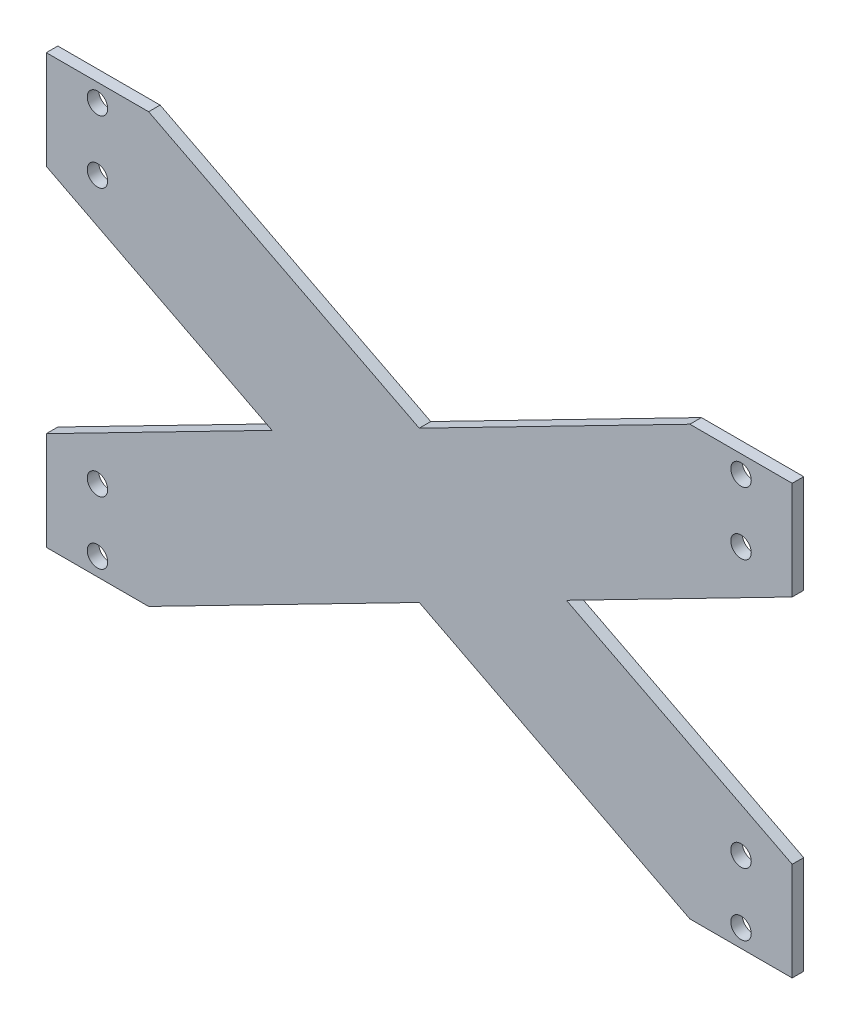
ISO-10303-21;
HEADER;
FILE_DESCRIPTION(('STEP AP214'),'2;1');
FILE_NAME('part.step','',(''),(''),'','','');
FILE_SCHEMA(('AUTOMOTIVE_DESIGN { 1 0 10303 214 1 1 1 1 }'));
ENDSEC;
DATA;
#1=APPLICATION_CONTEXT('core data for automotive mechanical design processes');
#2=APPLICATION_PROTOCOL_DEFINITION('international standard','automotive_design',2000,#1);
#3=PRODUCT_CONTEXT('',#1,'mechanical');
#4=PRODUCT('Part','Part','',(#3));
#5=PRODUCT_RELATED_PRODUCT_CATEGORY('part','',(#4));
#6=PRODUCT_DEFINITION_FORMATION('','',#4);
#7=PRODUCT_DEFINITION_CONTEXT('part definition',#1,'design');
#8=PRODUCT_DEFINITION('design','',#6,#7);
#9=PRODUCT_DEFINITION_SHAPE('','',#8);
#10=(LENGTH_UNIT() NAMED_UNIT(*) SI_UNIT(.MILLI.,.METRE.));
#11=(NAMED_UNIT(*) PLANE_ANGLE_UNIT() SI_UNIT($,.RADIAN.));
#12=(NAMED_UNIT(*) SI_UNIT($,.STERADIAN.) SOLID_ANGLE_UNIT());
#13=UNCERTAINTY_MEASURE_WITH_UNIT(LENGTH_MEASURE(1.E-05),#10,'distance_accuracy_value','');
#14=(GEOMETRIC_REPRESENTATION_CONTEXT(3) GLOBAL_UNCERTAINTY_ASSIGNED_CONTEXT((#13)) GLOBAL_UNIT_ASSIGNED_CONTEXT((#10,
#11,#12)) REPRESENTATION_CONTEXT('',''));
#15=CARTESIAN_POINT('',(0.,0.,0.));
#16=DIRECTION('',(0.,0.,1.));
#17=DIRECTION('',(1.,0.,0.));
#18=AXIS2_PLACEMENT_3D('',#15,#16,#17);
#19=CARTESIAN_POINT('',(69.3272628310759,-135.215033552703,4.5));
#20=DIRECTION('',(0.456244842629436,-0.88985428221369,0.));
#21=DIRECTION('',(0.88985428221369,0.456244842629436,0.));
#22=AXIS2_PLACEMENT_3D('',#19,#20,#21);
#23=PLANE('',#22);
#24=DIRECTION('',(-0.88985428221369,-0.456244842629436,0.));
#25=VECTOR('',#24,1.);
#26=CARTESIAN_POINT('',(69.3272628310759,-135.215033552703,0.));
#27=LINE('',#26,#25);
#28=CARTESIAN_POINT('',(152.142010442395,-92.7543720190779,0.));
#29=VERTEX_POINT('',#28);
#30=CARTESIAN_POINT('',(46.3420104423945,-147.,0.));
#31=VERTEX_POINT('',#30);
#32=EDGE_CURVE('E217',#29,#31,#27,.T.);
#33=ORIENTED_EDGE('',*,*,#32,.F.);
#34=DIRECTION('',(0.,0.,-1.));
#35=VECTOR('',#34,1.);
#36=CARTESIAN_POINT('',(152.142010442395,-92.7543720190779,4.5));
#37=LINE('',#36,#35);
#38=CARTESIAN_POINT('',(152.142010442395,-92.7543720190779,4.5));
#39=VERTEX_POINT('',#38);
#40=EDGE_CURVE('E11',#39,#29,#37,.T.);
#41=ORIENTED_EDGE('',*,*,#40,.F.);
#42=DIRECTION('',(-0.88985428221369,-0.456244842629436,0.));
#43=VECTOR('',#42,1.);
#44=CARTESIAN_POINT('',(69.3272628310759,-135.215033552703,4.5));
#45=LINE('',#44,#43);
#46=CARTESIAN_POINT('',(46.3420104423945,-147.,4.5));
#47=VERTEX_POINT('',#46);
#48=EDGE_CURVE('E393',#39,#47,#45,.T.);
#49=ORIENTED_EDGE('',*,*,#48,.T.);
#50=DIRECTION('',(0.,0.,-1.));
#51=VECTOR('',#50,1.);
#52=CARTESIAN_POINT('',(46.3420104423945,-147.,4.5));
#53=LINE('',#52,#51);
#54=EDGE_CURVE('E110',#47,#31,#53,.T.);
#55=ORIENTED_EDGE('',*,*,#54,.T.);
#56=EDGE_LOOP('',(#33,#41,#49,#55));
#57=FACE_BOUND('',#56,.T.);
#58=ADVANCED_FACE('F35',(#57),#23,.T.);
#59=CARTESIAN_POINT('',(-5.98769687299524,-11.6783297150822,4.5));
#60=DIRECTION('',(0.456244842629436,0.88985428221369,0.));
#61=DIRECTION('',(-0.88985428221369,0.456244842629436,0.));
#62=AXIS2_PLACEMENT_3D('',#59,#60,#61);
#63=PLANE('',#62);
#64=DIRECTION('',(0.88985428221369,-0.456244842629436,0.));
#65=VECTOR('',#64,1.);
#66=CARTESIAN_POINT('',(-5.98769687299524,-11.6783297150822,0.));
#67=LINE('',#66,#65);
#68=CARTESIAN_POINT('',(257.942010442395,-147.,0.));
#69=VERTEX_POINT('',#68);
#70=EDGE_CURVE('E215',#29,#69,#67,.T.);
#71=ORIENTED_EDGE('',*,*,#70,.T.);
#72=DIRECTION('',(0.,0.,-1.));
#73=VECTOR('',#72,1.);
#74=CARTESIAN_POINT('',(257.942010442395,-147.,4.5));
#75=LINE('',#74,#73);
#76=CARTESIAN_POINT('',(257.942010442395,-147.,4.5));
#77=VERTEX_POINT('',#76);
#78=EDGE_CURVE('E44',#77,#69,#75,.T.);
#79=ORIENTED_EDGE('',*,*,#78,.F.);
#80=DIRECTION('',(0.88985428221369,-0.456244842629436,0.));
#81=VECTOR('',#80,1.);
#82=CARTESIAN_POINT('',(-5.98769687299524,-11.6783297150822,4.5));
#83=LINE('',#82,#81);
#84=EDGE_CURVE('E395',#39,#77,#83,.T.);
#85=ORIENTED_EDGE('',*,*,#84,.F.);
#86=ORIENTED_EDGE('',*,*,#40,.T.);
#87=EDGE_LOOP('',(#71,#79,#85,#86));
#88=FACE_BOUND('',#87,.T.);
#89=ADVANCED_FACE('F216',(#88),#63,.F.);
#90=CARTESIAN_POINT('',(0.,-147.,4.5));
#91=DIRECTION('',(0.,1.,0.));
#92=DIRECTION('',(0.,0.,1.));
#93=AXIS2_PLACEMENT_3D('',#90,#91,#92);
#94=PLANE('',#93);
#95=DIRECTION('',(1.,0.,0.));
#96=VECTOR('',#95,1.);
#97=CARTESIAN_POINT('',(0.,-147.,0.));
#98=LINE('',#97,#96);
#99=CARTESIAN_POINT('',(297.942010442395,-147.,0.));
#100=VERTEX_POINT('',#99);
#101=EDGE_CURVE('E209',#69,#100,#98,.T.);
#102=ORIENTED_EDGE('',*,*,#101,.T.);
#103=DIRECTION('',(0.,0.,-1.));
#104=VECTOR('',#103,1.);
#105=CARTESIAN_POINT('',(297.942010442395,-147.,4.5));
#106=LINE('',#105,#104);
#107=CARTESIAN_POINT('',(297.942010442395,-147.,4.5));
#108=VERTEX_POINT('',#107);
#109=EDGE_CURVE('E201',#108,#100,#106,.T.);
#110=ORIENTED_EDGE('',*,*,#109,.F.);
#111=DIRECTION('',(1.,0.,0.));
#112=VECTOR('',#111,1.);
#113=CARTESIAN_POINT('',(0.,-147.,4.5));
#114=LINE('',#113,#112);
#115=EDGE_CURVE('E211',#77,#108,#114,.T.);
#116=ORIENTED_EDGE('',*,*,#115,.F.);
#117=ORIENTED_EDGE('',*,*,#78,.T.);
#118=EDGE_LOOP('',(#102,#110,#116,#117));
#119=FACE_BOUND('',#118,.T.);
#120=ADVANCED_FACE('F207',(#119),#94,.F.);
#121=CARTESIAN_POINT('',(297.942010442395,0.,4.5));
#122=DIRECTION('',(1.,0.,0.));
#123=DIRECTION('',(0.,0.,-1.));
#124=AXIS2_PLACEMENT_3D('',#121,#122,#123);
#125=PLANE('',#124);
#126=DIRECTION('',(0.,-1.,0.));
#127=VECTOR('',#126,1.);
#128=CARTESIAN_POINT('',(297.942010442395,0.,0.));
#129=LINE('',#128,#127);
#130=CARTESIAN_POINT('',(297.942010442395,-108.5,0.));
#131=VERTEX_POINT('',#130);
#132=EDGE_CURVE('E219',#131,#100,#129,.T.);
#133=ORIENTED_EDGE('',*,*,#132,.F.);
#134=DIRECTION('',(0.,0.,-1.));
#135=VECTOR('',#134,1.);
#136=CARTESIAN_POINT('',(297.942010442395,-108.5,4.5));
#137=LINE('',#136,#135);
#138=CARTESIAN_POINT('',(297.942010442395,-108.5,4.5));
#139=VERTEX_POINT('',#138);
#140=EDGE_CURVE('E199',#139,#131,#137,.T.);
#141=ORIENTED_EDGE('',*,*,#140,.F.);
#142=DIRECTION('',(0.,-1.,0.));
#143=VECTOR('',#142,1.);
#144=CARTESIAN_POINT('',(297.942010442395,0.,4.5));
#145=LINE('',#144,#143);
#146=EDGE_CURVE('E401',#139,#108,#145,.T.);
#147=ORIENTED_EDGE('',*,*,#146,.T.);
#148=ORIENTED_EDGE('',*,*,#109,.T.);
#149=EDGE_LOOP('',(#133,#141,#147,#148));
#150=FACE_BOUND('',#149,.T.);
#151=ADVANCED_FACE('F316',(#150),#125,.T.);
#152=CARTESIAN_POINT('',(17.9693473216841,35.047192140587,4.5));
#153=DIRECTION('',(-0.456244842629436,-0.88985428221369,0.));
#154=DIRECTION('',(0.88985428221369,-0.456244842629436,0.));
#155=AXIS2_PLACEMENT_3D('',#152,#153,#154);
#156=PLANE('',#155);
#157=DIRECTION('',(-0.88985428221369,0.456244842629436,0.));
#158=VECTOR('',#157,1.);
#159=CARTESIAN_POINT('',(17.9693473216841,35.047192140587,0.));
#160=LINE('',#159,#158);
#161=CARTESIAN_POINT('',(209.686971682705,-63.2499999999999,0.));
#162=VERTEX_POINT('',#161);
#163=EDGE_CURVE('E226',#131,#162,#160,.T.);
#164=ORIENTED_EDGE('',*,*,#163,.T.);
#165=DIRECTION('',(0.,0.,-1.));
#166=VECTOR('',#165,1.);
#167=CARTESIAN_POINT('',(209.686971682705,-63.2499999999999,4.5));
#168=LINE('',#167,#166);
#169=CARTESIAN_POINT('',(209.686971682705,-63.2499999999999,4.5));
#170=VERTEX_POINT('',#169);
#171=EDGE_CURVE('E197',#170,#162,#168,.T.);
#172=ORIENTED_EDGE('',*,*,#171,.F.);
#173=DIRECTION('',(-0.88985428221369,0.456244842629436,0.));
#174=VECTOR('',#173,1.);
#175=CARTESIAN_POINT('',(17.9693473216841,35.047192140587,4.5));
#176=LINE('',#175,#174);
#177=EDGE_CURVE('E404',#139,#170,#176,.T.);
#178=ORIENTED_EDGE('',*,*,#177,.F.);
#179=ORIENTED_EDGE('',*,*,#140,.T.);
#180=EDGE_LOOP('',(#164,#172,#178,#179));
#181=FACE_BOUND('',#180,.T.);
#182=ADVANCED_FACE('F319',(#181),#156,.F.);
#183=CARTESIAN_POINT('',(69.3272628310759,-135.215033552703,4.5));
#184=DIRECTION('',(0.456244842629436,-0.88985428221369,0.));
#185=DIRECTION('',(0.88985428221369,0.456244842629436,0.));
#186=AXIS2_PLACEMENT_3D('',#183,#184,#185);
#187=PLANE('',#186);
#188=DIRECTION('',(-0.88985428221369,-0.456244842629436,0.));
#189=VECTOR('',#188,1.);
#190=CARTESIAN_POINT('',(69.3272628310759,-135.215033552703,0.));
#191=LINE('',#190,#189);
#192=CARTESIAN_POINT('',(297.942010442395,-17.9999999999999,0.));
#193=VERTEX_POINT('',#192);
#194=EDGE_CURVE('E229',#193,#162,#191,.T.);
#195=ORIENTED_EDGE('',*,*,#194,.F.);
#196=DIRECTION('',(0.,0.,-1.));
#197=VECTOR('',#196,1.);
#198=CARTESIAN_POINT('',(297.942010442395,-17.9999999999999,4.5));
#199=LINE('',#198,#197);
#200=CARTESIAN_POINT('',(297.942010442395,-17.9999999999999,4.5));
#201=VERTEX_POINT('',#200);
#202=EDGE_CURVE('E195',#201,#193,#199,.T.);
#203=ORIENTED_EDGE('',*,*,#202,.F.);
#204=DIRECTION('',(-0.88985428221369,-0.456244842629436,0.));
#205=VECTOR('',#204,1.);
#206=CARTESIAN_POINT('',(69.3272628310759,-135.215033552703,4.5));
#207=LINE('',#206,#205);
#208=EDGE_CURVE('E406',#201,#170,#207,.T.);
#209=ORIENTED_EDGE('',*,*,#208,.T.);
#210=ORIENTED_EDGE('',*,*,#171,.T.);
#211=EDGE_LOOP('',(#195,#203,#209,#210));
#212=FACE_BOUND('',#211,.T.);
#213=ADVANCED_FACE('F323',(#212),#187,.T.);
#214=CARTESIAN_POINT('',(297.942010442395,0.,4.5));
#215=DIRECTION('',(1.,0.,0.));
#216=DIRECTION('',(0.,0.,-1.));
#217=AXIS2_PLACEMENT_3D('',#214,#215,#216);
#218=PLANE('',#217);
#219=DIRECTION('',(0.,-1.,0.));
#220=VECTOR('',#219,1.);
#221=CARTESIAN_POINT('',(297.942010442395,0.,0.));
#222=LINE('',#221,#220);
#223=CARTESIAN_POINT('',(297.942010442395,20.5000000000001,0.));
#224=VERTEX_POINT('',#223);
#225=EDGE_CURVE('E232',#224,#193,#222,.T.);
#226=ORIENTED_EDGE('',*,*,#225,.F.);
#227=DIRECTION('',(0.,0.,-1.));
#228=VECTOR('',#227,1.);
#229=CARTESIAN_POINT('',(297.942010442395,20.5000000000001,4.5));
#230=LINE('',#229,#228);
#231=CARTESIAN_POINT('',(297.942010442395,20.5000000000001,4.5));
#232=VERTEX_POINT('',#231);
#233=EDGE_CURVE('E193',#232,#224,#230,.T.);
#234=ORIENTED_EDGE('',*,*,#233,.F.);
#235=DIRECTION('',(0.,-1.,0.));
#236=VECTOR('',#235,1.);
#237=CARTESIAN_POINT('',(297.942010442395,0.,4.5));
#238=LINE('',#237,#236);
#239=EDGE_CURVE('E409',#232,#201,#238,.T.);
#240=ORIENTED_EDGE('',*,*,#239,.T.);
#241=ORIENTED_EDGE('',*,*,#202,.T.);
#242=EDGE_LOOP('',(#226,#234,#240,#241));
#243=FACE_BOUND('',#242,.T.);
#244=ADVANCED_FACE('F327',(#243),#218,.T.);
#245=CARTESIAN_POINT('',(0.,20.5000000000001,4.5));
#246=DIRECTION('',(0.,1.,0.));
#247=DIRECTION('',(-1.,0.,0.));
#248=AXIS2_PLACEMENT_3D('',#245,#246,#247);
#249=PLANE('',#248);
#250=DIRECTION('',(1.,0.,0.));
#251=VECTOR('',#250,1.);
#252=CARTESIAN_POINT('',(0.,20.5000000000001,0.));
#253=LINE('',#252,#251);
#254=CARTESIAN_POINT('',(257.942010442395,20.5000000000001,0.));
#255=VERTEX_POINT('',#254);
#256=EDGE_CURVE('E235',#255,#224,#253,.T.);
#257=ORIENTED_EDGE('',*,*,#256,.F.);
#258=DIRECTION('',(0.,0.,-1.));
#259=VECTOR('',#258,1.);
#260=CARTESIAN_POINT('',(257.942010442395,20.5000000000001,4.5));
#261=LINE('',#260,#259);
#262=CARTESIAN_POINT('',(257.942010442395,20.5000000000001,4.5));
#263=VERTEX_POINT('',#262);
#264=EDGE_CURVE('E191',#263,#255,#261,.T.);
#265=ORIENTED_EDGE('',*,*,#264,.F.);
#266=DIRECTION('',(1.,0.,0.));
#267=VECTOR('',#266,1.);
#268=CARTESIAN_POINT('',(0.,20.5000000000001,4.5));
#269=LINE('',#268,#267);
#270=EDGE_CURVE('E412',#263,#232,#269,.T.);
#271=ORIENTED_EDGE('',*,*,#270,.T.);
#272=ORIENTED_EDGE('',*,*,#233,.T.);
#273=EDGE_LOOP('',(#257,#265,#271,#272));
#274=FACE_BOUND('',#273,.T.);
#275=ADVANCED_FACE('F331',(#274),#249,.T.);
#276=CARTESIAN_POINT('',(45.3702186363966,-88.4895116970339,4.5));
#277=DIRECTION('',(0.456244842629436,-0.88985428221369,0.));
#278=DIRECTION('',(0.88985428221369,0.456244842629436,0.));
#279=AXIS2_PLACEMENT_3D('',#276,#277,#278);
#280=PLANE('',#279);
#281=DIRECTION('',(-0.88985428221369,-0.456244842629436,0.));
#282=VECTOR('',#281,1.);
#283=CARTESIAN_POINT('',(45.3702186363966,-88.4895116970339,0.));
#284=LINE('',#283,#282);
#285=CARTESIAN_POINT('',(152.142010442395,-33.745627980922,0.));
#286=VERTEX_POINT('',#285);
#287=EDGE_CURVE('E238',#255,#286,#284,.T.);
#288=ORIENTED_EDGE('',*,*,#287,.T.);
#289=DIRECTION('',(0.,0.,-1.));
#290=VECTOR('',#289,1.);
#291=CARTESIAN_POINT('',(152.142010442395,-33.745627980922,4.5));
#292=LINE('',#291,#290);
#293=CARTESIAN_POINT('',(152.142010442395,-33.745627980922,4.5));
#294=VERTEX_POINT('',#293);
#295=EDGE_CURVE('E188',#294,#286,#292,.T.);
#296=ORIENTED_EDGE('',*,*,#295,.F.);
#297=DIRECTION('',(-0.88985428221369,-0.456244842629436,0.));
#298=VECTOR('',#297,1.);
#299=CARTESIAN_POINT('',(45.3702186363966,-88.4895116970339,4.5));
#300=LINE('',#299,#298);
#301=EDGE_CURVE('E415',#263,#294,#300,.T.);
#302=ORIENTED_EDGE('',*,*,#301,.F.);
#303=ORIENTED_EDGE('',*,*,#264,.T.);
#304=EDGE_LOOP('',(#288,#296,#302,#303));
#305=FACE_BOUND('',#304,.T.);
#306=ADVANCED_FACE('F335',(#305),#280,.F.);
#307=CARTESIAN_POINT('',(17.9693473216841,35.047192140587,4.5));
#308=DIRECTION('',(-0.456244842629436,-0.88985428221369,0.));
#309=DIRECTION('',(0.88985428221369,-0.456244842629436,0.));
#310=AXIS2_PLACEMENT_3D('',#307,#308,#309);
#311=PLANE('',#310);
#312=DIRECTION('',(-0.88985428221369,0.456244842629436,0.));
#313=VECTOR('',#312,1.);
#314=CARTESIAN_POINT('',(17.9693473216841,35.047192140587,0.));
#315=LINE('',#314,#313);
#316=CARTESIAN_POINT('',(46.3420104423947,20.5000000000001,0.));
#317=VERTEX_POINT('',#316);
#318=EDGE_CURVE('E241',#286,#317,#315,.T.);
#319=ORIENTED_EDGE('',*,*,#318,.T.);
#320=DIRECTION('',(0.,0.,-1.));
#321=VECTOR('',#320,1.);
#322=CARTESIAN_POINT('',(46.3420104423947,20.5000000000001,4.5));
#323=LINE('',#322,#321);
#324=CARTESIAN_POINT('',(46.3420104423947,20.5000000000001,4.5));
#325=VERTEX_POINT('',#324);
#326=EDGE_CURVE('E186',#325,#317,#323,.T.);
#327=ORIENTED_EDGE('',*,*,#326,.F.);
#328=DIRECTION('',(-0.88985428221369,0.456244842629436,0.));
#329=VECTOR('',#328,1.);
#330=CARTESIAN_POINT('',(17.9693473216841,35.047192140587,4.5));
#331=LINE('',#330,#329);
#332=EDGE_CURVE('E418',#294,#325,#331,.T.);
#333=ORIENTED_EDGE('',*,*,#332,.F.);
#334=ORIENTED_EDGE('',*,*,#295,.T.);
#335=EDGE_LOOP('',(#319,#327,#333,#334));
#336=FACE_BOUND('',#335,.T.);
#337=ADVANCED_FACE('F339',(#336),#311,.F.);
#338=CARTESIAN_POINT('',(0.,20.5000000000001,4.5));
#339=DIRECTION('',(0.,1.,0.));
#340=DIRECTION('',(-1.,0.,0.));
#341=AXIS2_PLACEMENT_3D('',#338,#339,#340);
#342=PLANE('',#341);
#343=DIRECTION('',(1.,0.,0.));
#344=VECTOR('',#343,1.);
#345=CARTESIAN_POINT('',(0.,20.5000000000001,0.));
#346=LINE('',#345,#344);
#347=CARTESIAN_POINT('',(6.34201044239465,20.5000000000001,0.));
#348=VERTEX_POINT('',#347);
#349=EDGE_CURVE('E244',#348,#317,#346,.T.);
#350=ORIENTED_EDGE('',*,*,#349,.F.);
#351=DIRECTION('',(0.,0.,-1.));
#352=VECTOR('',#351,1.);
#353=CARTESIAN_POINT('',(6.34201044239465,20.5000000000001,4.5));
#354=LINE('',#353,#352);
#355=CARTESIAN_POINT('',(6.34201044239465,20.5000000000001,4.5));
#356=VERTEX_POINT('',#355);
#357=EDGE_CURVE('E184',#356,#348,#354,.T.);
#358=ORIENTED_EDGE('',*,*,#357,.F.);
#359=DIRECTION('',(1.,0.,0.));
#360=VECTOR('',#359,1.);
#361=CARTESIAN_POINT('',(0.,20.5000000000001,4.5));
#362=LINE('',#361,#360);
#363=EDGE_CURVE('E420',#356,#325,#362,.T.);
#364=ORIENTED_EDGE('',*,*,#363,.T.);
#365=ORIENTED_EDGE('',*,*,#326,.T.);
#366=EDGE_LOOP('',(#350,#358,#364,#365));
#367=FACE_BOUND('',#366,.T.);
#368=ADVANCED_FACE('F343',(#367),#342,.T.);
#369=CARTESIAN_POINT('',(6.34201044239465,0.,4.5));
#370=DIRECTION('',(1.,0.,0.));
#371=DIRECTION('',(0.,1.,0.));
#372=AXIS2_PLACEMENT_3D('',#369,#370,#371);
#373=PLANE('',#372);
#374=DIRECTION('',(0.,-1.,0.));
#375=VECTOR('',#374,1.);
#376=CARTESIAN_POINT('',(6.34201044239465,0.,0.));
#377=LINE('',#376,#375);
#378=CARTESIAN_POINT('',(6.34201044239465,-17.9999999999999,0.));
#379=VERTEX_POINT('',#378);
#380=EDGE_CURVE('E247',#348,#379,#377,.T.);
#381=ORIENTED_EDGE('',*,*,#380,.T.);
#382=DIRECTION('',(0.,0.,-1.));
#383=VECTOR('',#382,1.);
#384=CARTESIAN_POINT('',(6.34201044239465,-17.9999999999999,4.5));
#385=LINE('',#384,#383);
#386=CARTESIAN_POINT('',(6.34201044239465,-17.9999999999999,4.5));
#387=VERTEX_POINT('',#386);
#388=EDGE_CURVE('E177',#387,#379,#385,.T.);
#389=ORIENTED_EDGE('',*,*,#388,.F.);
#390=DIRECTION('',(0.,-1.,0.));
#391=VECTOR('',#390,1.);
#392=CARTESIAN_POINT('',(6.34201044239465,0.,4.5));
#393=LINE('',#392,#391);
#394=EDGE_CURVE('E423',#356,#387,#393,.T.);
#395=ORIENTED_EDGE('',*,*,#394,.F.);
#396=ORIENTED_EDGE('',*,*,#357,.T.);
#397=EDGE_LOOP('',(#381,#389,#395,#396));
#398=FACE_BOUND('',#397,.T.);
#399=ADVANCED_FACE('F347',(#398),#373,.F.);
#400=CARTESIAN_POINT('',(-5.98769687299524,-11.6783297150822,4.5));
#401=DIRECTION('',(0.456244842629436,0.88985428221369,0.));
#402=DIRECTION('',(-0.88985428221369,0.456244842629436,0.));
#403=AXIS2_PLACEMENT_3D('',#400,#401,#402);
#404=PLANE('',#403);
#405=DIRECTION('',(0.88985428221369,-0.456244842629436,0.));
#406=VECTOR('',#405,1.);
#407=CARTESIAN_POINT('',(-5.98769687299524,-11.6783297150822,0.));
#408=LINE('',#407,#406);
#409=CARTESIAN_POINT('',(94.5970492020846,-63.2499999999999,0.));
#410=VERTEX_POINT('',#409);
#411=EDGE_CURVE('E250',#379,#410,#408,.T.);
#412=ORIENTED_EDGE('',*,*,#411,.T.);
#413=DIRECTION('',(0.,0.,-1.));
#414=VECTOR('',#413,1.);
#415=CARTESIAN_POINT('',(94.5970492020846,-63.2499999999999,4.5));
#416=LINE('',#415,#414);
#417=CARTESIAN_POINT('',(94.5970492020846,-63.2499999999999,4.5));
#418=VERTEX_POINT('',#417);
#419=EDGE_CURVE('E175',#418,#410,#416,.T.);
#420=ORIENTED_EDGE('',*,*,#419,.F.);
#421=DIRECTION('',(0.88985428221369,-0.456244842629436,0.));
#422=VECTOR('',#421,1.);
#423=CARTESIAN_POINT('',(-5.98769687299524,-11.6783297150822,4.5));
#424=LINE('',#423,#422);
#425=EDGE_CURVE('E168',#387,#418,#424,.T.);
#426=ORIENTED_EDGE('',*,*,#425,.F.);
#427=ORIENTED_EDGE('',*,*,#388,.T.);
#428=EDGE_LOOP('',(#412,#420,#426,#427));
#429=FACE_BOUND('',#428,.T.);
#430=ADVANCED_FACE('F351',(#429),#404,.F.);
#431=CARTESIAN_POINT('',(45.3702186363966,-88.4895116970339,4.5));
#432=DIRECTION('',(0.456244842629436,-0.88985428221369,0.));
#433=DIRECTION('',(0.88985428221369,0.456244842629436,0.));
#434=AXIS2_PLACEMENT_3D('',#431,#432,#433);
#435=PLANE('',#434);
#436=DIRECTION('',(-0.88985428221369,-0.456244842629436,0.));
#437=VECTOR('',#436,1.);
#438=CARTESIAN_POINT('',(45.3702186363966,-88.4895116970339,0.));
#439=LINE('',#438,#437);
#440=CARTESIAN_POINT('',(6.34201044239466,-108.5,0.));
#441=VERTEX_POINT('',#440);
#442=EDGE_CURVE('E174',#410,#441,#439,.T.);
#443=ORIENTED_EDGE('',*,*,#442,.T.);
#444=DIRECTION('',(0.,0.,-1.));
#445=VECTOR('',#444,1.);
#446=CARTESIAN_POINT('',(6.34201044239466,-108.5,4.5));
#447=LINE('',#446,#445);
#448=CARTESIAN_POINT('',(6.34201044239466,-108.5,4.5));
#449=VERTEX_POINT('',#448);
#450=EDGE_CURVE('E159',#449,#441,#447,.T.);
#451=ORIENTED_EDGE('',*,*,#450,.F.);
#452=DIRECTION('',(-0.88985428221369,-0.456244842629436,0.));
#453=VECTOR('',#452,1.);
#454=CARTESIAN_POINT('',(45.3702186363966,-88.4895116970339,4.5));
#455=LINE('',#454,#453);
#456=EDGE_CURVE('E162',#418,#449,#455,.T.);
#457=ORIENTED_EDGE('',*,*,#456,.F.);
#458=ORIENTED_EDGE('',*,*,#419,.T.);
#459=EDGE_LOOP('',(#443,#451,#457,#458));
#460=FACE_BOUND('',#459,.T.);
#461=ADVANCED_FACE('F173',(#460),#435,.F.);
#462=CARTESIAN_POINT('',(6.34201044239465,0.,4.5));
#463=DIRECTION('',(1.,0.,0.));
#464=DIRECTION('',(0.,1.,0.));
#465=AXIS2_PLACEMENT_3D('',#462,#463,#464);
#466=PLANE('',#465);
#467=DIRECTION('',(0.,-1.,0.));
#468=VECTOR('',#467,1.);
#469=CARTESIAN_POINT('',(6.34201044239465,0.,0.));
#470=LINE('',#469,#468);
#471=CARTESIAN_POINT('',(6.34201044239466,-147.,0.));
#472=VERTEX_POINT('',#471);
#473=EDGE_CURVE('E254',#441,#472,#470,.T.);
#474=ORIENTED_EDGE('',*,*,#473,.T.);
#475=DIRECTION('',(0.,0.,-1.));
#476=VECTOR('',#475,1.);
#477=CARTESIAN_POINT('',(6.34201044239466,-147.,4.5));
#478=LINE('',#477,#476);
#479=CARTESIAN_POINT('',(6.34201044239466,-147.,4.5));
#480=VERTEX_POINT('',#479);
#481=EDGE_CURVE('E161',#480,#472,#478,.T.);
#482=ORIENTED_EDGE('',*,*,#481,.F.);
#483=DIRECTION('',(0.,-1.,0.));
#484=VECTOR('',#483,1.);
#485=CARTESIAN_POINT('',(6.34201044239465,0.,4.5));
#486=LINE('',#485,#484);
#487=EDGE_CURVE('E154',#449,#480,#486,.T.);
#488=ORIENTED_EDGE('',*,*,#487,.F.);
#489=ORIENTED_EDGE('',*,*,#450,.T.);
#490=EDGE_LOOP('',(#474,#482,#488,#489));
#491=FACE_BOUND('',#490,.T.);
#492=ADVANCED_FACE('F157',(#491),#466,.F.);
#493=CARTESIAN_POINT('',(277.942010442395,-140.,4.5));
#494=DIRECTION('',(0.,0.,-1.));
#495=DIRECTION('',(-1.,0.,0.));
#496=AXIS2_PLACEMENT_3D('',#493,#494,#495);
#497=CYLINDRICAL_SURFACE('',#496,3.99999999999999);
#498=CARTESIAN_POINT('',(277.942010442395,-140.,4.5));
#499=DIRECTION('',(0.,0.,1.));
#500=DIRECTION('',(1.,0.,0.));
#501=AXIS2_PLACEMENT_3D('',#498,#499,#500);
#502=CIRCLE('',#501,3.99999999999999);
#503=CARTESIAN_POINT('',(281.942010442395,-140.,4.5));
#504=VERTEX_POINT('',#503);
#505=EDGE_CURVE('E277',#504,#504,#502,.T.);
#506=ORIENTED_EDGE('',*,*,#505,.T.);
#507=EDGE_LOOP('',(#506));
#508=FACE_BOUND('',#507,.T.);
#509=CARTESIAN_POINT('',(277.942010442395,-140.,0.));
#510=DIRECTION('',(0.,0.,1.));
#511=DIRECTION('',(1.,0.,0.));
#512=AXIS2_PLACEMENT_3D('',#509,#510,#511);
#513=CIRCLE('',#512,3.99999999999999);
#514=CARTESIAN_POINT('',(281.942010442395,-140.,0.));
#515=VERTEX_POINT('',#514);
#516=EDGE_CURVE('E269',#515,#515,#513,.T.);
#517=ORIENTED_EDGE('',*,*,#516,.F.);
#518=EDGE_LOOP('',(#517));
#519=FACE_BOUND('',#518,.T.);
#520=ADVANCED_FACE('F359',(#508,#519),#497,.F.);
#521=CARTESIAN_POINT('',(277.942010442395,13.5,4.5));
#522=DIRECTION('',(0.,0.,-1.));
#523=DIRECTION('',(-1.,0.,0.));
#524=AXIS2_PLACEMENT_3D('',#521,#522,#523);
#525=CYLINDRICAL_SURFACE('',#524,3.99999999999999);
#526=CARTESIAN_POINT('',(277.942010442395,13.5,4.5));
#527=DIRECTION('',(0.,0.,1.));
#528=DIRECTION('',(1.,0.,0.));
#529=AXIS2_PLACEMENT_3D('',#526,#527,#528);
#530=CIRCLE('',#529,3.99999999999999);
#531=CARTESIAN_POINT('',(281.942010442395,13.5,4.5));
#532=VERTEX_POINT('',#531);
#533=EDGE_CURVE('E282',#532,#532,#530,.T.);
#534=ORIENTED_EDGE('',*,*,#533,.T.);
#535=EDGE_LOOP('',(#534));
#536=FACE_BOUND('',#535,.T.);
#537=CARTESIAN_POINT('',(277.942010442395,13.5,0.));
#538=DIRECTION('',(0.,0.,1.));
#539=DIRECTION('',(1.,0.,0.));
#540=AXIS2_PLACEMENT_3D('',#537,#538,#539);
#541=CIRCLE('',#540,3.99999999999999);
#542=CARTESIAN_POINT('',(281.942010442395,13.5,0.));
#543=VERTEX_POINT('',#542);
#544=EDGE_CURVE('E266',#543,#543,#541,.T.);
#545=ORIENTED_EDGE('',*,*,#544,.F.);
#546=EDGE_LOOP('',(#545));
#547=FACE_BOUND('',#546,.T.);
#548=ADVANCED_FACE('F371',(#536,#547),#525,.F.);
#549=CARTESIAN_POINT('',(277.942010442395,-11.,4.5));
#550=DIRECTION('',(0.,0.,-1.));
#551=DIRECTION('',(-1.,0.,0.));
#552=AXIS2_PLACEMENT_3D('',#549,#550,#551);
#553=CYLINDRICAL_SURFACE('',#552,3.99999999999999);
#554=CARTESIAN_POINT('',(277.942010442395,-11.,4.5));
#555=DIRECTION('',(0.,0.,1.));
#556=DIRECTION('',(1.,0.,0.));
#557=AXIS2_PLACEMENT_3D('',#554,#555,#556);
#558=CIRCLE('',#557,3.99999999999999);
#559=CARTESIAN_POINT('',(281.942010442395,-11.,4.5));
#560=VERTEX_POINT('',#559);
#561=EDGE_CURVE('E433',#560,#560,#558,.T.);
#562=ORIENTED_EDGE('',*,*,#561,.T.);
#563=EDGE_LOOP('',(#562));
#564=FACE_BOUND('',#563,.T.);
#565=CARTESIAN_POINT('',(277.942010442395,-11.,0.));
#566=DIRECTION('',(0.,0.,1.));
#567=DIRECTION('',(1.,0.,0.));
#568=AXIS2_PLACEMENT_3D('',#565,#566,#567);
#569=CIRCLE('',#568,3.99999999999999);
#570=CARTESIAN_POINT('',(281.942010442395,-11.,0.));
#571=VERTEX_POINT('',#570);
#572=EDGE_CURVE('E263',#571,#571,#569,.T.);
#573=ORIENTED_EDGE('',*,*,#572,.F.);
#574=EDGE_LOOP('',(#573));
#575=FACE_BOUND('',#574,.T.);
#576=ADVANCED_FACE('F367',(#564,#575),#553,.F.);
#577=CARTESIAN_POINT('',(26.3420104423946,13.5000000000001,4.5));
#578=DIRECTION('',(0.,0.,-1.));
#579=DIRECTION('',(-1.,0.,0.));
#580=AXIS2_PLACEMENT_3D('',#577,#578,#579);
#581=CYLINDRICAL_SURFACE('',#580,4.);
#582=CARTESIAN_POINT('',(26.3420104423946,13.5000000000001,4.5));
#583=DIRECTION('',(0.,0.,1.));
#584=DIRECTION('',(1.,0.,0.));
#585=AXIS2_PLACEMENT_3D('',#582,#583,#584);
#586=CIRCLE('',#585,4.);
#587=CARTESIAN_POINT('',(30.3420104423946,13.5000000000001,4.5));
#588=VERTEX_POINT('',#587);
#589=EDGE_CURVE('E430',#588,#588,#586,.T.);
#590=ORIENTED_EDGE('',*,*,#589,.T.);
#591=EDGE_LOOP('',(#590));
#592=FACE_BOUND('',#591,.T.);
#593=CARTESIAN_POINT('',(26.3420104423946,13.5000000000001,0.));
#594=DIRECTION('',(0.,0.,1.));
#595=DIRECTION('',(1.,0.,0.));
#596=AXIS2_PLACEMENT_3D('',#593,#594,#595);
#597=CIRCLE('',#596,4.);
#598=CARTESIAN_POINT('',(30.3420104423946,13.5000000000001,0.));
#599=VERTEX_POINT('',#598);
#600=EDGE_CURVE('E260',#599,#599,#597,.T.);
#601=ORIENTED_EDGE('',*,*,#600,.F.);
#602=EDGE_LOOP('',(#601));
#603=FACE_BOUND('',#602,.T.);
#604=ADVANCED_FACE('F363',(#592,#603),#581,.F.);
#605=CARTESIAN_POINT('',(26.3420104423946,-10.9999999999999,4.5));
#606=DIRECTION('',(0.,0.,-1.));
#607=DIRECTION('',(-1.,0.,0.));
#608=AXIS2_PLACEMENT_3D('',#605,#606,#607);
#609=CYLINDRICAL_SURFACE('',#608,3.99999999999999);
#610=CARTESIAN_POINT('',(26.3420104423946,-10.9999999999999,4.5));
#611=DIRECTION('',(0.,0.,1.));
#612=DIRECTION('',(1.,0.,0.));
#613=AXIS2_PLACEMENT_3D('',#610,#611,#612);
#614=CIRCLE('',#613,3.99999999999999);
#615=CARTESIAN_POINT('',(30.3420104423946,-10.9999999999999,4.5));
#616=VERTEX_POINT('',#615);
#617=EDGE_CURVE('E427',#616,#616,#614,.T.);
#618=ORIENTED_EDGE('',*,*,#617,.T.);
#619=EDGE_LOOP('',(#618));
#620=FACE_BOUND('',#619,.T.);
#621=CARTESIAN_POINT('',(26.3420104423946,-10.9999999999999,0.));
#622=DIRECTION('',(0.,0.,1.));
#623=DIRECTION('',(1.,0.,0.));
#624=AXIS2_PLACEMENT_3D('',#621,#622,#623);
#625=CIRCLE('',#624,3.99999999999999);
#626=CARTESIAN_POINT('',(30.3420104423946,-10.9999999999999,0.));
#627=VERTEX_POINT('',#626);
#628=EDGE_CURVE('E257',#627,#627,#625,.T.);
#629=ORIENTED_EDGE('',*,*,#628,.F.);
#630=EDGE_LOOP('',(#629));
#631=FACE_BOUND('',#630,.T.);
#632=ADVANCED_FACE('F303',(#620,#631),#609,.F.);
#633=CARTESIAN_POINT('',(0.,-147.,4.5));
#634=DIRECTION('',(0.,1.,0.));
#635=DIRECTION('',(0.,0.,1.));
#636=AXIS2_PLACEMENT_3D('',#633,#634,#635);
#637=PLANE('',#636);
#638=DIRECTION('',(1.,0.,0.));
#639=VECTOR('',#638,1.);
#640=CARTESIAN_POINT('',(0.,-147.,0.));
#641=LINE('',#640,#639);
#642=EDGE_CURVE('E103',#472,#31,#641,.T.);
#643=ORIENTED_EDGE('',*,*,#642,.T.);
#644=ORIENTED_EDGE('',*,*,#54,.F.);
#645=DIRECTION('',(1.,0.,0.));
#646=VECTOR('',#645,1.);
#647=CARTESIAN_POINT('',(0.,-147.,4.5));
#648=LINE('',#647,#646);
#649=EDGE_CURVE('E52',#480,#47,#648,.T.);
#650=ORIENTED_EDGE('',*,*,#649,.F.);
#651=ORIENTED_EDGE('',*,*,#481,.T.);
#652=EDGE_LOOP('',(#643,#644,#650,#651));
#653=FACE_BOUND('',#652,.T.);
#654=ADVANCED_FACE('F295',(#653),#637,.F.);
#655=CARTESIAN_POINT('',(26.3420104423945,-115.5,4.5));
#656=DIRECTION('',(0.,0.,-1.));
#657=DIRECTION('',(-1.,0.,0.));
#658=AXIS2_PLACEMENT_3D('',#655,#656,#657);
#659=CYLINDRICAL_SURFACE('',#658,4.);
#660=CARTESIAN_POINT('',(26.3420104423945,-115.5,4.5));
#661=DIRECTION('',(0.,0.,1.));
#662=DIRECTION('',(1.,0.,0.));
#663=AXIS2_PLACEMENT_3D('',#660,#661,#662);
#664=CIRCLE('',#663,4.);
#665=CARTESIAN_POINT('',(30.3420104423945,-115.5,4.5));
#666=VERTEX_POINT('',#665);
#667=EDGE_CURVE('E392',#666,#666,#664,.T.);
#668=ORIENTED_EDGE('',*,*,#667,.T.);
#669=EDGE_LOOP('',(#668));
#670=FACE_BOUND('',#669,.T.);
#671=CARTESIAN_POINT('',(26.3420104423945,-115.5,0.));
#672=DIRECTION('',(0.,0.,1.));
#673=DIRECTION('',(1.,0.,0.));
#674=AXIS2_PLACEMENT_3D('',#671,#672,#673);
#675=CIRCLE('',#674,4.);
#676=CARTESIAN_POINT('',(30.3420104423945,-115.5,0.));
#677=VERTEX_POINT('',#676);
#678=EDGE_CURVE('E221',#677,#677,#675,.T.);
#679=ORIENTED_EDGE('',*,*,#678,.F.);
#680=EDGE_LOOP('',(#679));
#681=FACE_BOUND('',#680,.T.);
#682=ADVANCED_FACE('F293',(#670,#681),#659,.F.);
#683=CARTESIAN_POINT('',(26.3420104423945,-140.,4.5));
#684=DIRECTION('',(0.,0.,-1.));
#685=DIRECTION('',(-1.,0.,0.));
#686=AXIS2_PLACEMENT_3D('',#683,#684,#685);
#687=CYLINDRICAL_SURFACE('',#686,4.);
#688=CARTESIAN_POINT('',(26.3420104423945,-140.,4.5));
#689=DIRECTION('',(0.,0.,1.));
#690=DIRECTION('',(1.,0.,0.));
#691=AXIS2_PLACEMENT_3D('',#688,#689,#690);
#692=CIRCLE('',#691,4.);
#693=CARTESIAN_POINT('',(30.3420104423945,-140.,4.5));
#694=VERTEX_POINT('',#693);
#695=EDGE_CURVE('E274',#694,#694,#692,.T.);
#696=ORIENTED_EDGE('',*,*,#695,.T.);
#697=EDGE_LOOP('',(#696));
#698=FACE_BOUND('',#697,.T.);
#699=CARTESIAN_POINT('',(26.3420104423945,-140.,0.));
#700=DIRECTION('',(0.,0.,1.));
#701=DIRECTION('',(1.,0.,0.));
#702=AXIS2_PLACEMENT_3D('',#699,#700,#701);
#703=CIRCLE('',#702,4.);
#704=CARTESIAN_POINT('',(30.3420104423945,-140.,0.));
#705=VERTEX_POINT('',#704);
#706=EDGE_CURVE('E286',#705,#705,#703,.T.);
#707=ORIENTED_EDGE('',*,*,#706,.F.);
#708=EDGE_LOOP('',(#707));
#709=FACE_BOUND('',#708,.T.);
#710=ADVANCED_FACE('F37',(#698,#709),#687,.F.);
#711=CARTESIAN_POINT('',(277.942010442395,-115.5,4.5));
#712=DIRECTION('',(0.,0.,-1.));
#713=DIRECTION('',(-1.,0.,0.));
#714=AXIS2_PLACEMENT_3D('',#711,#712,#713);
#715=CYLINDRICAL_SURFACE('',#714,3.99999999999999);
#716=CARTESIAN_POINT('',(277.942010442395,-115.5,4.5));
#717=DIRECTION('',(0.,0.,1.));
#718=DIRECTION('',(1.,0.,0.));
#719=AXIS2_PLACEMENT_3D('',#716,#717,#718);
#720=CIRCLE('',#719,3.99999999999999);
#721=CARTESIAN_POINT('',(281.942010442395,-115.5,4.5));
#722=VERTEX_POINT('',#721);
#723=EDGE_CURVE('E275',#722,#722,#720,.T.);
#724=ORIENTED_EDGE('',*,*,#723,.T.);
#725=EDGE_LOOP('',(#724));
#726=FACE_BOUND('',#725,.T.);
#727=CARTESIAN_POINT('',(277.942010442395,-115.5,0.));
#728=DIRECTION('',(0.,0.,1.));
#729=DIRECTION('',(1.,0.,0.));
#730=AXIS2_PLACEMENT_3D('',#727,#728,#729);
#731=CIRCLE('',#730,3.99999999999999);
#732=CARTESIAN_POINT('',(281.942010442395,-115.5,0.));
#733=VERTEX_POINT('',#732);
#734=EDGE_CURVE('E272',#733,#733,#731,.T.);
#735=ORIENTED_EDGE('',*,*,#734,.F.);
#736=EDGE_LOOP('',(#735));
#737=FACE_BOUND('',#736,.T.);
#738=ADVANCED_FACE('F301',(#726,#737),#715,.F.);
#739=CARTESIAN_POINT('',(0.,0.,4.5));
#740=DIRECTION('',(0.,0.,1.));
#741=DIRECTION('',(1.,0.,0.));
#742=AXIS2_PLACEMENT_3D('',#739,#740,#741);
#743=PLANE('',#742);
#744=ORIENTED_EDGE('',*,*,#695,.F.);
#745=EDGE_LOOP('',(#744));
#746=FACE_BOUND('',#745,.T.);
#747=ORIENTED_EDGE('',*,*,#667,.F.);
#748=EDGE_LOOP('',(#747));
#749=FACE_BOUND('',#748,.T.);
#750=ORIENTED_EDGE('',*,*,#48,.F.);
#751=ORIENTED_EDGE('',*,*,#84,.T.);
#752=ORIENTED_EDGE('',*,*,#115,.T.);
#753=ORIENTED_EDGE('',*,*,#146,.F.);
#754=ORIENTED_EDGE('',*,*,#177,.T.);
#755=ORIENTED_EDGE('',*,*,#208,.F.);
#756=ORIENTED_EDGE('',*,*,#239,.F.);
#757=ORIENTED_EDGE('',*,*,#270,.F.);
#758=ORIENTED_EDGE('',*,*,#301,.T.);
#759=ORIENTED_EDGE('',*,*,#332,.T.);
#760=ORIENTED_EDGE('',*,*,#363,.F.);
#761=ORIENTED_EDGE('',*,*,#394,.T.);
#762=ORIENTED_EDGE('',*,*,#425,.T.);
#763=ORIENTED_EDGE('',*,*,#456,.T.);
#764=ORIENTED_EDGE('',*,*,#487,.T.);
#765=ORIENTED_EDGE('',*,*,#649,.T.);
#766=EDGE_LOOP('',(#750,#751,#752,#753,#754,#755,#756,#757,#758,#759,#760,#761,#762,#763,#764,#765));
#767=FACE_BOUND('',#766,.T.);
#768=ORIENTED_EDGE('',*,*,#617,.F.);
#769=EDGE_LOOP('',(#768));
#770=FACE_BOUND('',#769,.T.);
#771=ORIENTED_EDGE('',*,*,#589,.F.);
#772=EDGE_LOOP('',(#771));
#773=FACE_BOUND('',#772,.T.);
#774=ORIENTED_EDGE('',*,*,#561,.F.);
#775=EDGE_LOOP('',(#774));
#776=FACE_BOUND('',#775,.T.);
#777=ORIENTED_EDGE('',*,*,#533,.F.);
#778=EDGE_LOOP('',(#777));
#779=FACE_BOUND('',#778,.T.);
#780=ORIENTED_EDGE('',*,*,#505,.F.);
#781=EDGE_LOOP('',(#780));
#782=FACE_BOUND('',#781,.T.);
#783=ORIENTED_EDGE('',*,*,#723,.F.);
#784=EDGE_LOOP('',(#783));
#785=FACE_BOUND('',#784,.T.);
#786=ADVANCED_FACE('F165',(#746,#749,#767,#770,#773,#776,#779,#782,#785),#743,.T.);
#787=CARTESIAN_POINT('',(0.,0.,0.));
#788=DIRECTION('',(0.,0.,1.));
#789=DIRECTION('',(1.,0.,0.));
#790=AXIS2_PLACEMENT_3D('',#787,#788,#789);
#791=PLANE('',#790);
#792=ORIENTED_EDGE('',*,*,#706,.T.);
#793=EDGE_LOOP('',(#792));
#794=FACE_BOUND('',#793,.T.);
#795=ORIENTED_EDGE('',*,*,#678,.T.);
#796=EDGE_LOOP('',(#795));
#797=FACE_BOUND('',#796,.T.);
#798=ORIENTED_EDGE('',*,*,#32,.T.);
#799=ORIENTED_EDGE('',*,*,#642,.F.);
#800=ORIENTED_EDGE('',*,*,#473,.F.);
#801=ORIENTED_EDGE('',*,*,#442,.F.);
#802=ORIENTED_EDGE('',*,*,#411,.F.);
#803=ORIENTED_EDGE('',*,*,#380,.F.);
#804=ORIENTED_EDGE('',*,*,#349,.T.);
#805=ORIENTED_EDGE('',*,*,#318,.F.);
#806=ORIENTED_EDGE('',*,*,#287,.F.);
#807=ORIENTED_EDGE('',*,*,#256,.T.);
#808=ORIENTED_EDGE('',*,*,#225,.T.);
#809=ORIENTED_EDGE('',*,*,#194,.T.);
#810=ORIENTED_EDGE('',*,*,#163,.F.);
#811=ORIENTED_EDGE('',*,*,#132,.T.);
#812=ORIENTED_EDGE('',*,*,#101,.F.);
#813=ORIENTED_EDGE('',*,*,#70,.F.);
#814=EDGE_LOOP('',(#798,#799,#800,#801,#802,#803,#804,#805,#806,#807,#808,#809,#810,#811,#812,#813));
#815=FACE_BOUND('',#814,.T.);
#816=ORIENTED_EDGE('',*,*,#628,.T.);
#817=EDGE_LOOP('',(#816));
#818=FACE_BOUND('',#817,.T.);
#819=ORIENTED_EDGE('',*,*,#600,.T.);
#820=EDGE_LOOP('',(#819));
#821=FACE_BOUND('',#820,.T.);
#822=ORIENTED_EDGE('',*,*,#572,.T.);
#823=EDGE_LOOP('',(#822));
#824=FACE_BOUND('',#823,.T.);
#825=ORIENTED_EDGE('',*,*,#544,.T.);
#826=EDGE_LOOP('',(#825));
#827=FACE_BOUND('',#826,.T.);
#828=ORIENTED_EDGE('',*,*,#516,.T.);
#829=EDGE_LOOP('',(#828));
#830=FACE_BOUND('',#829,.T.);
#831=ORIENTED_EDGE('',*,*,#734,.T.);
#832=EDGE_LOOP('',(#831));
#833=FACE_BOUND('',#832,.T.);
#834=ADVANCED_FACE('F291',(#794,#797,#815,#818,#821,#824,#827,#830,#833),#791,.F.);
#835=CLOSED_SHELL('',(#58,#89,#120,#151,#182,#213,#244,#275,#306,#337,#368,#399,#430,#461,#492,
#520,#548,#576,#604,#632,#654,#682,#710,#738,#786,#834));
#836=MANIFOLD_SOLID_BREP('B2',#835);
#837=ADVANCED_BREP_SHAPE_REPRESENTATION('',(#18,#836),#14);
#838=SHAPE_DEFINITION_REPRESENTATION(#9,#837);
ENDSEC;
END-ISO-10303-21;
